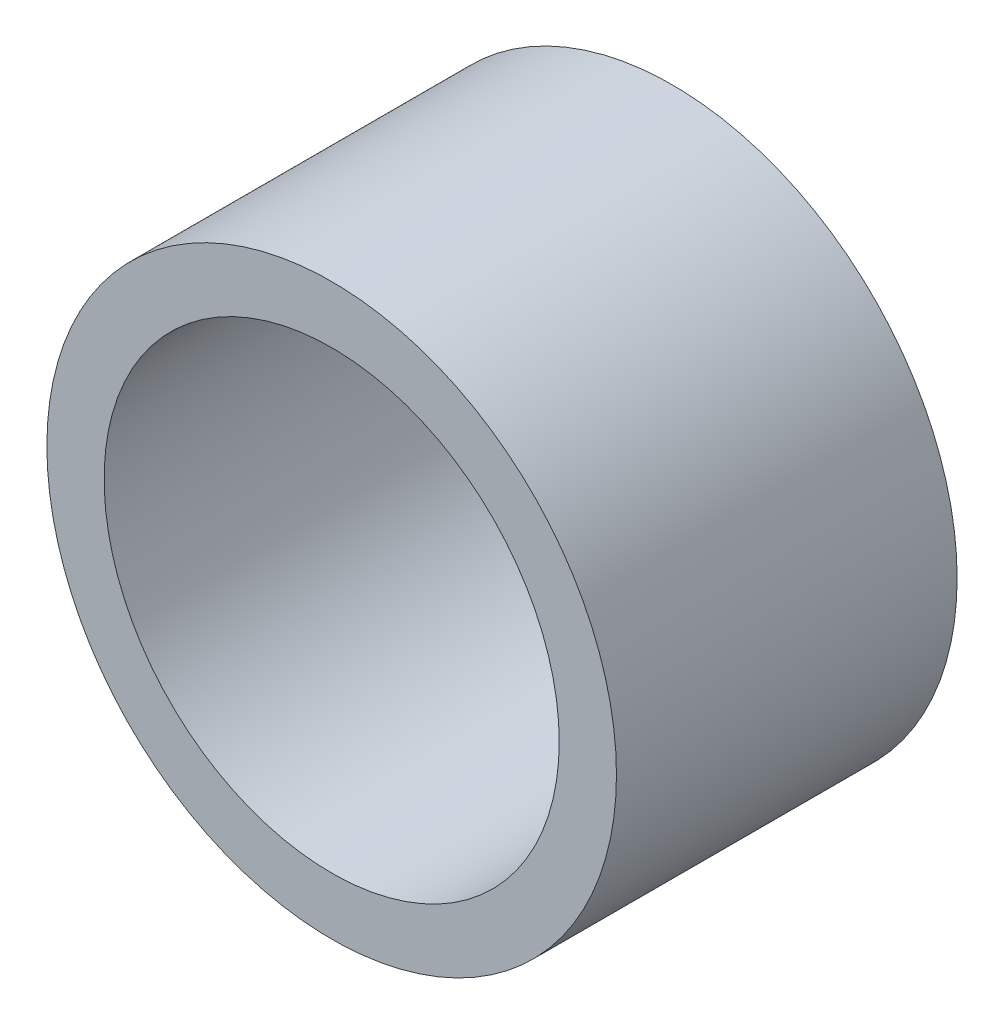
ISO-10303-21;
HEADER;
FILE_DESCRIPTION(('STEP AP214'),'2;1');
FILE_NAME('part.step','',(''),(''),'','','');
FILE_SCHEMA(('AUTOMOTIVE_DESIGN { 1 0 10303 214 1 1 1 1 }'));
ENDSEC;
DATA;
#1=APPLICATION_CONTEXT('core data for automotive mechanical design processes');
#2=APPLICATION_PROTOCOL_DEFINITION('international standard','automotive_design',2000,#1);
#3=PRODUCT_CONTEXT('',#1,'mechanical');
#4=PRODUCT('Part','Part','',(#3));
#5=PRODUCT_RELATED_PRODUCT_CATEGORY('part','',(#4));
#6=PRODUCT_DEFINITION_FORMATION('','',#4);
#7=PRODUCT_DEFINITION_CONTEXT('part definition',#1,'design');
#8=PRODUCT_DEFINITION('design','',#6,#7);
#9=PRODUCT_DEFINITION_SHAPE('','',#8);
#10=(LENGTH_UNIT() NAMED_UNIT(*) SI_UNIT(.MILLI.,.METRE.));
#11=(NAMED_UNIT(*) PLANE_ANGLE_UNIT() SI_UNIT($,.RADIAN.));
#12=(NAMED_UNIT(*) SI_UNIT($,.STERADIAN.) SOLID_ANGLE_UNIT());
#13=UNCERTAINTY_MEASURE_WITH_UNIT(LENGTH_MEASURE(1.E-05),#10,'distance_accuracy_value','');
#14=(GEOMETRIC_REPRESENTATION_CONTEXT(3) GLOBAL_UNCERTAINTY_ASSIGNED_CONTEXT((#13)) GLOBAL_UNIT_ASSIGNED_CONTEXT((#10,
#11,#12)) REPRESENTATION_CONTEXT('',''));
#15=CARTESIAN_POINT('',(0.,0.,0.));
#16=DIRECTION('',(0.,0.,1.));
#17=DIRECTION('',(1.,0.,0.));
#18=AXIS2_PLACEMENT_3D('',#15,#16,#17);
#19=CARTESIAN_POINT('',(0.,0.,4.7625));
#20=DIRECTION('',(0.,0.,1.));
#21=DIRECTION('',(1.,0.,0.));
#22=AXIS2_PLACEMENT_3D('',#19,#20,#21);
#23=PLANE('',#22);
#24=CARTESIAN_POINT('',(0.,0.,4.7625));
#25=DIRECTION('',(0.,0.,1.));
#26=DIRECTION('',(1.,0.,0.));
#27=AXIS2_PLACEMENT_3D('',#24,#25,#26);
#28=CIRCLE('',#27,7.9629);
#29=CARTESIAN_POINT('',(7.9629,0.,4.7625));
#30=VERTEX_POINT('',#29);
#31=EDGE_CURVE('E10',#30,#30,#28,.T.);
#32=ORIENTED_EDGE('',*,*,#31,.T.);
#33=EDGE_LOOP('',(#32));
#34=FACE_BOUND('',#33,.T.);
#35=CARTESIAN_POINT('',(0.,0.,4.7625));
#36=DIRECTION('',(0.,0.,1.));
#37=DIRECTION('',(1.,0.,0.));
#38=AXIS2_PLACEMENT_3D('',#35,#36,#37);
#39=CIRCLE('',#38,6.3627);
#40=CARTESIAN_POINT('',(6.3627,0.,4.7625));
#41=VERTEX_POINT('',#40);
#42=EDGE_CURVE('E42',#41,#41,#39,.T.);
#43=ORIENTED_EDGE('',*,*,#42,.F.);
#44=EDGE_LOOP('',(#43));
#45=FACE_BOUND('',#44,.T.);
#46=ADVANCED_FACE('F31',(#34,#45),#23,.T.);
#47=CARTESIAN_POINT('',(0.,0.,-4.7625));
#48=DIRECTION('',(0.,0.,1.));
#49=DIRECTION('',(1.,0.,0.));
#50=AXIS2_PLACEMENT_3D('',#47,#48,#49);
#51=PLANE('',#50);
#52=CARTESIAN_POINT('',(0.,0.,-4.7625));
#53=DIRECTION('',(0.,0.,1.));
#54=DIRECTION('',(1.,0.,0.));
#55=AXIS2_PLACEMENT_3D('',#52,#53,#54);
#56=CIRCLE('',#55,7.9629);
#57=CARTESIAN_POINT('',(7.9629,0.,-4.7625));
#58=VERTEX_POINT('',#57);
#59=EDGE_CURVE('E35',#58,#58,#56,.T.);
#60=ORIENTED_EDGE('',*,*,#59,.F.);
#61=EDGE_LOOP('',(#60));
#62=FACE_BOUND('',#61,.T.);
#63=CARTESIAN_POINT('',(0.,0.,-4.7625));
#64=DIRECTION('',(0.,0.,1.));
#65=DIRECTION('',(1.,0.,0.));
#66=AXIS2_PLACEMENT_3D('',#63,#64,#65);
#67=CIRCLE('',#66,6.3627);
#68=CARTESIAN_POINT('',(6.3627,0.,-4.7625));
#69=VERTEX_POINT('',#68);
#70=EDGE_CURVE('E44',#69,#69,#67,.T.);
#71=ORIENTED_EDGE('',*,*,#70,.T.);
#72=EDGE_LOOP('',(#71));
#73=FACE_BOUND('',#72,.T.);
#74=ADVANCED_FACE('F54',(#62,#73),#51,.F.);
#75=CARTESIAN_POINT('',(0.,0.,4.7625));
#76=DIRECTION('',(0.,0.,-1.));
#77=DIRECTION('',(-1.,0.,0.));
#78=AXIS2_PLACEMENT_3D('',#75,#76,#77);
#79=CYLINDRICAL_SURFACE('',#78,7.9629);
#80=ORIENTED_EDGE('',*,*,#31,.F.);
#81=EDGE_LOOP('',(#80));
#82=FACE_BOUND('',#81,.T.);
#83=ORIENTED_EDGE('',*,*,#59,.T.);
#84=EDGE_LOOP('',(#83));
#85=FACE_BOUND('',#84,.T.);
#86=ADVANCED_FACE('F33',(#82,#85),#79,.T.);
#87=CARTESIAN_POINT('',(0.,0.,4.7625));
#88=DIRECTION('',(0.,0.,-1.));
#89=DIRECTION('',(-1.,0.,0.));
#90=AXIS2_PLACEMENT_3D('',#87,#88,#89);
#91=CYLINDRICAL_SURFACE('',#90,6.3627);
#92=ORIENTED_EDGE('',*,*,#42,.T.);
#93=EDGE_LOOP('',(#92));
#94=FACE_BOUND('',#93,.T.);
#95=ORIENTED_EDGE('',*,*,#70,.F.);
#96=EDGE_LOOP('',(#95));
#97=FACE_BOUND('',#96,.T.);
#98=ADVANCED_FACE('F50',(#94,#97),#91,.F.);
#99=CLOSED_SHELL('',(#46,#74,#86,#98));
#100=MANIFOLD_SOLID_BREP('B2',#99);
#101=ADVANCED_BREP_SHAPE_REPRESENTATION('',(#18,#100),#14);
#102=SHAPE_DEFINITION_REPRESENTATION(#9,#101);
ENDSEC;
END-ISO-10303-21;
